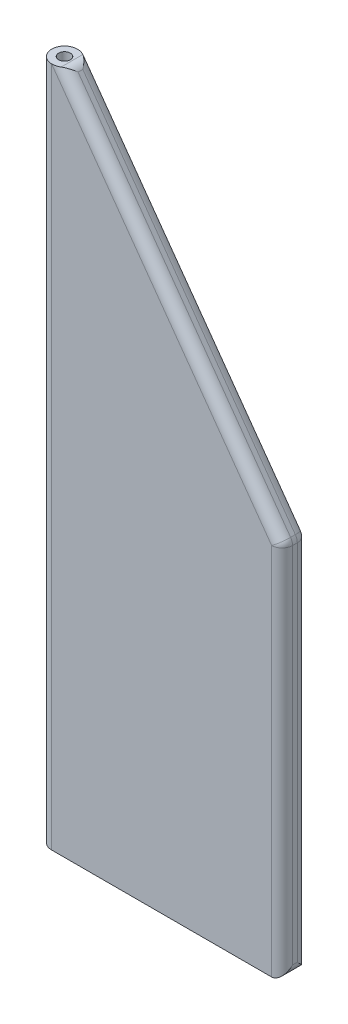
ISO-10303-21;
HEADER;
FILE_DESCRIPTION(('STEP AP214'),'2;1');
FILE_NAME('part.step','',(''),(''),'','','');
FILE_SCHEMA(('AUTOMOTIVE_DESIGN { 1 0 10303 214 1 1 1 1 }'));
ENDSEC;
DATA;
#1=APPLICATION_CONTEXT('core data for automotive mechanical design processes');
#2=APPLICATION_PROTOCOL_DEFINITION('international standard','automotive_design',2000,#1);
#3=PRODUCT_CONTEXT('',#1,'mechanical');
#4=PRODUCT('Part','Part','',(#3));
#5=PRODUCT_RELATED_PRODUCT_CATEGORY('part','',(#4));
#6=PRODUCT_DEFINITION_FORMATION('','',#4);
#7=PRODUCT_DEFINITION_CONTEXT('part definition',#1,'design');
#8=PRODUCT_DEFINITION('design','',#6,#7);
#9=PRODUCT_DEFINITION_SHAPE('','',#8);
#10=(LENGTH_UNIT() NAMED_UNIT(*) SI_UNIT(.MILLI.,.METRE.));
#11=(NAMED_UNIT(*) PLANE_ANGLE_UNIT() SI_UNIT($,.RADIAN.));
#12=(NAMED_UNIT(*) SI_UNIT($,.STERADIAN.) SOLID_ANGLE_UNIT());
#13=UNCERTAINTY_MEASURE_WITH_UNIT(LENGTH_MEASURE(1.E-05),#10,'distance_accuracy_value','');
#14=(GEOMETRIC_REPRESENTATION_CONTEXT(3) GLOBAL_UNCERTAINTY_ASSIGNED_CONTEXT((#13)) GLOBAL_UNIT_ASSIGNED_CONTEXT((#10,
#11,#12)) REPRESENTATION_CONTEXT('',''));
#15=CARTESIAN_POINT('',(0.,0.,0.));
#16=DIRECTION('',(0.,0.,1.));
#17=DIRECTION('',(1.,0.,0.));
#18=AXIS2_PLACEMENT_3D('',#15,#16,#17);
#19=CARTESIAN_POINT('',(0.,65.,0.));
#20=DIRECTION('',(0.,-1.,0.));
#21=DIRECTION('',(0.,0.,-1.));
#22=AXIS2_PLACEMENT_3D('',#19,#20,#21);
#23=CYLINDRICAL_SURFACE('',#22,1.225);
#24=DIRECTION('',(0.,-1.,0.));
#25=VECTOR('',#24,1.);
#26=CARTESIAN_POINT('',(0.,36.,1.225));
#27=LINE('',#26,#25);
#28=CARTESIAN_POINT('',(0.,64.992850620897,1.225));
#29=VERTEX_POINT('',#28);
#30=CARTESIAN_POINT('',(0.,0.,1.225));
#31=VERTEX_POINT('',#30);
#32=EDGE_CURVE('E139',#29,#31,#27,.T.);
#33=ORIENTED_EDGE('',*,*,#32,.F.);
#34=CARTESIAN_POINT('',(0.0459834894753985,65.,1.22413664216811));
#35=CARTESIAN_POINT('',(0.0337902166278973,64.9981051293374,1.22459461310516));
#36=CARTESIAN_POINT('',(0.0215947006379805,64.9962091906921,1.22487038492549));
#37=CARTESIAN_POINT('',(0.00626477557659393,64.9938250667613,1.22498798542231));
#38=CARTESIAN_POINT('',(0.00313246174137936,64.9933378790389,1.22499999954595));
#39=CARTESIAN_POINT('',(0.,64.992850620897,1.225));
#40=B_SPLINE_CURVE_WITH_KNOTS('',3,(#34,#35,#36,#37,#38,#39),.UNSPECIFIED.,.F.,.F.,(4,2,4),(0.,
0.0370352695863958,0.0465452630461256),.UNSPECIFIED.);
#41=CARTESIAN_POINT('',(0.0459834894753985,65.,1.22413664216811));
#42=VERTEX_POINT('',#41);
#43=EDGE_CURVE('E11',#29,#42,#40,.F.);
#44=ORIENTED_EDGE('',*,*,#43,.T.);
#45=CARTESIAN_POINT('',(0.,65.,0.));
#46=DIRECTION('',(0.,1.,0.));
#47=DIRECTION('',(0.,0.,1.));
#48=AXIS2_PLACEMENT_3D('',#45,#46,#47);
#49=CIRCLE('',#48,1.225);
#50=CARTESIAN_POINT('',(0.0459834894745959,65.,-1.22413664216814));
#51=VERTEX_POINT('',#50);
#52=EDGE_CURVE('E163',#51,#42,#49,.T.);
#53=ORIENTED_EDGE('',*,*,#52,.F.);
#54=CARTESIAN_POINT('',(0.0459834894745959,65.,-1.22413664216814));
#55=CARTESIAN_POINT('',(0.033790216627214,64.9981051293383,-1.22459461310517));
#56=CARTESIAN_POINT('',(0.0215947006375322,64.9962091906932,-1.22487038492549));
#57=CARTESIAN_POINT('',(0.00626477557651987,64.9938250667617,-1.22498798542231));
#58=CARTESIAN_POINT('',(0.0031324617413366,64.9933378790392,-1.22499999954595));
#59=CARTESIAN_POINT('',(0.,64.992850620897,-1.225));
#60=B_SPLINE_CURVE_WITH_KNOTS('',3,(#54,#55,#56,#57,#58,#59),.UNSPECIFIED.,.F.,.F.,(4,2,4),(0.,
0.0370352695856073,0.0465452630453359),.UNSPECIFIED.);
#61=CARTESIAN_POINT('',(0.,64.992850620897,-1.225));
#62=VERTEX_POINT('',#61);
#63=EDGE_CURVE('E53',#51,#62,#60,.T.);
#64=ORIENTED_EDGE('',*,*,#63,.T.);
#65=DIRECTION('',(0.,-1.,0.));
#66=VECTOR('',#65,1.);
#67=CARTESIAN_POINT('',(0.,36.,-1.225));
#68=LINE('',#67,#66);
#69=CARTESIAN_POINT('',(0.,0.,-1.225));
#70=VERTEX_POINT('',#69);
#71=EDGE_CURVE('E130',#62,#70,#68,.T.);
#72=ORIENTED_EDGE('',*,*,#71,.T.);
#73=CARTESIAN_POINT('',(0.,0.,0.));
#74=DIRECTION('',(0.,1.,0.));
#75=DIRECTION('',(0.,0.,1.));
#76=AXIS2_PLACEMENT_3D('',#73,#74,#75);
#77=CIRCLE('',#76,1.225);
#78=EDGE_CURVE('E133',#70,#31,#77,.T.);
#79=ORIENTED_EDGE('',*,*,#78,.T.);
#80=EDGE_LOOP('',(#33,#44,#53,#64,#72,#79));
#81=FACE_BOUND('',#80,.T.);
#82=ADVANCED_FACE('F42',(#81),#23,.T.);
#83=CARTESIAN_POINT('',(0.,65.,0.));
#84=DIRECTION('',(0.,-1.,0.));
#85=DIRECTION('',(0.,0.,-1.));
#86=AXIS2_PLACEMENT_3D('',#83,#84,#85);
#87=CYLINDRICAL_SURFACE('',#86,0.56);
#88=CARTESIAN_POINT('',(0.,65.,0.));
#89=DIRECTION('',(0.,1.,0.));
#90=DIRECTION('',(0.,0.,1.));
#91=AXIS2_PLACEMENT_3D('',#88,#89,#90);
#92=CIRCLE('',#91,0.56);
#93=CARTESIAN_POINT('',(0.,65.,0.56));
#94=VERTEX_POINT('',#93);
#95=EDGE_CURVE('E149',#94,#94,#92,.T.);
#96=ORIENTED_EDGE('',*,*,#95,.T.);
#97=EDGE_LOOP('',(#96));
#98=FACE_BOUND('',#97,.T.);
#99=CARTESIAN_POINT('',(0.,0.,0.));
#100=DIRECTION('',(0.,1.,0.));
#101=DIRECTION('',(0.,0.,1.));
#102=AXIS2_PLACEMENT_3D('',#99,#100,#101);
#103=CIRCLE('',#102,0.56);
#104=CARTESIAN_POINT('',(0.,0.,0.56));
#105=VERTEX_POINT('',#104);
#106=EDGE_CURVE('E150',#105,#105,#103,.T.);
#107=ORIENTED_EDGE('',*,*,#106,.F.);
#108=EDGE_LOOP('',(#107));
#109=FACE_BOUND('',#108,.T.);
#110=ADVANCED_FACE('F227',(#98,#109),#87,.F.);
#111=CARTESIAN_POINT('',(0.,65.,0.));
#112=DIRECTION('',(0.,1.,0.));
#113=DIRECTION('',(0.,0.,1.));
#114=AXIS2_PLACEMENT_3D('',#111,#112,#113);
#115=PLANE('',#114);
#116=ORIENTED_EDGE('',*,*,#95,.F.);
#117=EDGE_LOOP('',(#116));
#118=FACE_BOUND('',#117,.T.);
#119=CARTESIAN_POINT('',(-0.00512166727121769,65.,-0.225000000000003));
#120=DIRECTION('',(0.,1.,0.));
#121=DIRECTION('',(1.,0.,0.));
#122=AXIS2_PLACEMENT_3D('',#119,#120,#121);
#123=ELLIPSE('',#122,1.23012166727122,1.);
#124=CARTESIAN_POINT('',(0.711257643073609,65.,-1.03792771813239));
#125=VERTEX_POINT('',#124);
#126=EDGE_CURVE('E198',#125,#51,#123,.T.);
#127=ORIENTED_EDGE('',*,*,#126,.T.);
#128=ORIENTED_EDGE('',*,*,#52,.T.);
#129=CARTESIAN_POINT('',(-0.00512166727121774,65.,0.225));
#130=DIRECTION('',(0.,1.,0.));
#131=DIRECTION('',(1.,0.,0.));
#132=AXIS2_PLACEMENT_3D('',#129,#130,#131);
#133=ELLIPSE('',#132,1.23012166727122,1.);
#134=CARTESIAN_POINT('',(0.711257643073609,65.,1.03792771813239));
#135=VERTEX_POINT('',#134);
#136=EDGE_CURVE('E192',#42,#135,#133,.T.);
#137=ORIENTED_EDGE('',*,*,#136,.T.);
#138=DIRECTION('',(0.,0.,-1.));
#139=VECTOR('',#138,1.);
#140=CARTESIAN_POINT('',(0.711257643073609,65.,-1.225));
#141=LINE('',#140,#139);
#142=EDGE_CURVE('E195',#135,#125,#141,.T.);
#143=ORIENTED_EDGE('',*,*,#142,.T.);
#144=EDGE_LOOP('',(#127,#128,#137,#143));
#145=FACE_BOUND('',#144,.T.);
#146=ADVANCED_FACE('F232',(#118,#145),#115,.T.);
#147=CARTESIAN_POINT('',(0.,0.,0.));
#148=DIRECTION('',(0.,1.,0.));
#149=DIRECTION('',(0.,0.,1.));
#150=AXIS2_PLACEMENT_3D('',#147,#148,#149);
#151=PLANE('',#150);
#152=ORIENTED_EDGE('',*,*,#106,.T.);
#153=EDGE_LOOP('',(#152));
#154=FACE_BOUND('',#153,.T.);
#155=DIRECTION('',(1.,0.,0.));
#156=VECTOR('',#155,1.);
#157=CARTESIAN_POINT('',(0.,0.,-1.225));
#158=LINE('',#157,#156);
#159=CARTESIAN_POINT('',(21.,0.,-1.225));
#160=VERTEX_POINT('',#159);
#161=EDGE_CURVE('E140',#70,#160,#158,.T.);
#162=ORIENTED_EDGE('',*,*,#161,.T.);
#163=DIRECTION('',(0.,0.,1.));
#164=VECTOR('',#163,1.);
#165=CARTESIAN_POINT('',(21.,0.,1.225));
#166=LINE('',#165,#164);
#167=CARTESIAN_POINT('',(21.,0.,1.225));
#168=VERTEX_POINT('',#167);
#169=EDGE_CURVE('E190',#160,#168,#166,.T.);
#170=ORIENTED_EDGE('',*,*,#169,.T.);
#171=DIRECTION('',(-1.,0.,0.));
#172=VECTOR('',#171,1.);
#173=CARTESIAN_POINT('',(0.,0.,1.225));
#174=LINE('',#173,#172);
#175=EDGE_CURVE('E148',#168,#31,#174,.T.);
#176=ORIENTED_EDGE('',*,*,#175,.T.);
#177=ORIENTED_EDGE('',*,*,#78,.F.);
#178=EDGE_LOOP('',(#162,#170,#176,#177));
#179=FACE_BOUND('',#178,.T.);
#180=ADVANCED_FACE('F145',(#154,#179),#151,.F.);
#181=CARTESIAN_POINT('',(0.,36.,1.225));
#182=DIRECTION('',(0.,0.,1.));
#183=DIRECTION('',(1.,0.,0.));
#184=AXIS2_PLACEMENT_3D('',#181,#182,#183);
#185=PLANE('',#184);
#186=ORIENTED_EDGE('',*,*,#175,.F.);
#187=DIRECTION('',(0.,-1.,0.));
#188=VECTOR('',#187,1.);
#189=CARTESIAN_POINT('',(21.,36.,1.225));
#190=LINE('',#189,#188);
#191=CARTESIAN_POINT('',(21.,35.6787711985143,1.225));
#192=VERTEX_POINT('',#191);
#193=EDGE_CURVE('E182',#168,#192,#190,.F.);
#194=ORIENTED_EDGE('',*,*,#193,.T.);
#195=DIRECTION('',(-0.582364598075873,0.812927718132386,0.));
#196=VECTOR('',#195,1.);
#197=CARTESIAN_POINT('',(0.412072281867616,64.4176354019241,1.225));
#198=LINE('',#197,#196);
#199=EDGE_CURVE('E179',#192,#29,#198,.T.);
#200=ORIENTED_EDGE('',*,*,#199,.T.);
#201=ORIENTED_EDGE('',*,*,#32,.T.);
#202=EDGE_LOOP('',(#186,#194,#200,#201));
#203=FACE_BOUND('',#202,.T.);
#204=ADVANCED_FACE('F321',(#203),#185,.T.);
#205=CARTESIAN_POINT('',(22.,36.,0.));
#206=DIRECTION('',(1.,0.,0.));
#207=DIRECTION('',(0.,0.,-1.));
#208=AXIS2_PLACEMENT_3D('',#205,#206,#207);
#209=PLANE('',#208);
#210=DIRECTION('',(0.,-1.,0.));
#211=VECTOR('',#210,1.);
#212=CARTESIAN_POINT('',(22.,36.,0.224999999999998));
#213=LINE('',#212,#211);
#214=CARTESIAN_POINT('',(22.,35.6787711985143,0.224999999999998));
#215=VERTEX_POINT('',#214);
#216=CARTESIAN_POINT('',(22.,1.,0.224999999999998));
#217=VERTEX_POINT('',#216);
#218=EDGE_CURVE('E173',#215,#217,#213,.T.);
#219=ORIENTED_EDGE('',*,*,#218,.T.);
#220=DIRECTION('',(0.,0.,1.));
#221=VECTOR('',#220,1.);
#222=CARTESIAN_POINT('',(22.,1.,-1.225));
#223=LINE('',#222,#221);
#224=CARTESIAN_POINT('',(22.,1.,-0.224999999999998));
#225=VERTEX_POINT('',#224);
#226=EDGE_CURVE('E177',#217,#225,#223,.F.);
#227=ORIENTED_EDGE('',*,*,#226,.T.);
#228=DIRECTION('',(0.,-1.,0.));
#229=VECTOR('',#228,1.);
#230=CARTESIAN_POINT('',(22.,36.,-0.224999999999998));
#231=LINE('',#230,#229);
#232=CARTESIAN_POINT('',(22.,35.6787711985143,-0.224999999999998));
#233=VERTEX_POINT('',#232);
#234=EDGE_CURVE('E170',#225,#233,#231,.F.);
#235=ORIENTED_EDGE('',*,*,#234,.T.);
#236=DIRECTION('',(0.,0.,1.));
#237=VECTOR('',#236,1.);
#238=CARTESIAN_POINT('',(22.,35.6787711985143,1.225));
#239=LINE('',#238,#237);
#240=EDGE_CURVE('E166',#233,#215,#239,.T.);
#241=ORIENTED_EDGE('',*,*,#240,.T.);
#242=EDGE_LOOP('',(#219,#227,#235,#241));
#243=FACE_BOUND('',#242,.T.);
#244=ADVANCED_FACE('F312',(#243),#209,.T.);
#245=CARTESIAN_POINT('',(0.,36.,-1.225));
#246=DIRECTION('',(0.,0.,-1.));
#247=DIRECTION('',(-1.,0.,0.));
#248=AXIS2_PLACEMENT_3D('',#245,#246,#247);
#249=PLANE('',#248);
#250=DIRECTION('',(-0.582364598075873,0.812927718132386,0.));
#251=VECTOR('',#250,1.);
#252=CARTESIAN_POINT('',(21.1870722818676,35.4176354019241,-1.225));
#253=LINE('',#252,#251);
#254=CARTESIAN_POINT('',(21.,35.6787711985143,-1.225));
#255=VERTEX_POINT('',#254);
#256=EDGE_CURVE('E185',#62,#255,#253,.F.);
#257=ORIENTED_EDGE('',*,*,#256,.T.);
#258=DIRECTION('',(0.,-1.,0.));
#259=VECTOR('',#258,1.);
#260=CARTESIAN_POINT('',(21.,36.,-1.225));
#261=LINE('',#260,#259);
#262=EDGE_CURVE('E154',#255,#160,#261,.T.);
#263=ORIENTED_EDGE('',*,*,#262,.T.);
#264=ORIENTED_EDGE('',*,*,#161,.F.);
#265=ORIENTED_EDGE('',*,*,#71,.F.);
#266=EDGE_LOOP('',(#257,#263,#264,#265));
#267=FACE_BOUND('',#266,.T.);
#268=ADVANCED_FACE('F152',(#267),#249,.T.);
#269=CARTESIAN_POINT('',(1.225,65.,37.6255494464026));
#270=DIRECTION('',(-0.812927718132386,-0.582364598075873,0.));
#271=DIRECTION('',(0.582364598075873,-0.812927718132386,0.));
#272=AXIS2_PLACEMENT_3D('',#269,#270,#271);
#273=PLANE('',#272);
#274=DIRECTION('',(-0.582364598075873,0.812927718132386,0.));
#275=VECTOR('',#274,1.);
#276=CARTESIAN_POINT('',(1.225,65.,-0.225000000000003));
#277=LINE('',#276,#275);
#278=CARTESIAN_POINT('',(21.8129277181324,36.2611357965902,-0.225000000000001));
#279=VERTEX_POINT('',#278);
#280=CARTESIAN_POINT('',(1.52418536120599,64.5823645980759,-0.225000000000003));
#281=VERTEX_POINT('',#280);
#282=EDGE_CURVE('E64',#279,#281,#277,.T.);
#283=ORIENTED_EDGE('',*,*,#282,.T.);
#284=DIRECTION('',(0.,0.,-1.));
#285=VECTOR('',#284,1.);
#286=CARTESIAN_POINT('',(1.52418536120599,64.5823645980759,1.225));
#287=LINE('',#286,#285);
#288=CARTESIAN_POINT('',(1.52418536120599,64.5823645980759,0.225));
#289=VERTEX_POINT('',#288);
#290=EDGE_CURVE('E208',#281,#289,#287,.F.);
#291=ORIENTED_EDGE('',*,*,#290,.T.);
#292=DIRECTION('',(-0.582364598075873,0.812927718132386,0.));
#293=VECTOR('',#292,1.);
#294=CARTESIAN_POINT('',(22.,36.,0.224999999999998));
#295=LINE('',#294,#293);
#296=CARTESIAN_POINT('',(21.8129277181324,36.2611357965902,0.224999999999998));
#297=VERTEX_POINT('',#296);
#298=EDGE_CURVE('E202',#289,#297,#295,.F.);
#299=ORIENTED_EDGE('',*,*,#298,.T.);
#300=DIRECTION('',(0.,0.,1.));
#301=VECTOR('',#300,1.);
#302=CARTESIAN_POINT('',(21.8129277181324,36.2611357965902,-1.225));
#303=LINE('',#302,#301);
#304=EDGE_CURVE('E69',#297,#279,#303,.F.);
#305=ORIENTED_EDGE('',*,*,#304,.T.);
#306=EDGE_LOOP('',(#283,#291,#299,#305));
#307=FACE_BOUND('',#306,.T.);
#308=ADVANCED_FACE('F268',(#307),#273,.F.);
#309=CARTESIAN_POINT('',(0.412072281867616,64.4176354019241,-0.225000000000003));
#310=DIRECTION('',(0.582364598075873,-0.812927718132386,0.));
#311=DIRECTION('',(0.812927718132386,0.582364598075873,0.));
#312=AXIS2_PLACEMENT_3D('',#309,#310,#311);
#313=CYLINDRICAL_SURFACE('',#312,1.);
#314=ORIENTED_EDGE('',*,*,#63,.F.);
#315=ORIENTED_EDGE('',*,*,#126,.F.);
#316=CARTESIAN_POINT('',(0.711257643073609,64.,-0.225000000000003));
#317=DIRECTION('',(0.411793956422428,-0.574826702105916,-0.707106781186547));
#318=DIRECTION('',(0.411793956422428,-0.574826702105916,0.707106781186547));
#319=AXIS2_PLACEMENT_3D('',#316,#317,#318);
#320=ELLIPSE('',#319,1.4142135623731,1.);
#321=EDGE_CURVE('E47',#281,#125,#320,.F.);
#322=ORIENTED_EDGE('',*,*,#321,.F.);
#323=ORIENTED_EDGE('',*,*,#282,.F.);
#324=CARTESIAN_POINT('',(21.,35.6787711985143,-0.224999999999998));
#325=DIRECTION('',(0.582364598075872,-0.812927718132386,0.));
#326=DIRECTION('',(0.812927718132386,0.582364598075872,0.));
#327=AXIS2_PLACEMENT_3D('',#324,#325,#326);
#328=CIRCLE('',#327,1.);
#329=EDGE_CURVE('E277',#255,#279,#328,.T.);
#330=ORIENTED_EDGE('',*,*,#329,.F.);
#331=ORIENTED_EDGE('',*,*,#256,.F.);
#332=EDGE_LOOP('',(#314,#315,#322,#323,#330,#331));
#333=FACE_BOUND('',#332,.T.);
#334=ADVANCED_FACE('F44',(#333),#313,.T.);
#335=CARTESIAN_POINT('',(0.711257643073609,64.,0.));
#336=DIRECTION('',(0.,0.,1.));
#337=DIRECTION('',(1.,0.,0.));
#338=AXIS2_PLACEMENT_3D('',#335,#336,#337);
#339=CYLINDRICAL_SURFACE('',#338,1.);
#340=ORIENTED_EDGE('',*,*,#321,.T.);
#341=ORIENTED_EDGE('',*,*,#142,.F.);
#342=CARTESIAN_POINT('',(0.711257643073607,64.,0.225));
#343=DIRECTION('',(0.411793956422428,-0.574826702105916,0.707106781186547));
#344=DIRECTION('',(0.411793956422428,-0.574826702105916,-0.707106781186547));
#345=AXIS2_PLACEMENT_3D('',#342,#343,#344);
#346=ELLIPSE('',#345,1.4142135623731,1.);
#347=EDGE_CURVE('E280',#289,#135,#346,.T.);
#348=ORIENTED_EDGE('',*,*,#347,.F.);
#349=ORIENTED_EDGE('',*,*,#290,.F.);
#350=EDGE_LOOP('',(#340,#341,#348,#349));
#351=FACE_BOUND('',#350,.T.);
#352=ADVANCED_FACE('F260',(#351),#339,.T.);
#353=CARTESIAN_POINT('',(21.,35.6787711985143,-0.224999999999998));
#354=DIRECTION('',(0.,0.,1.));
#355=DIRECTION('',(1.,0.,0.));
#356=AXIS2_PLACEMENT_3D('',#353,#354,#355);
#357=SPHERICAL_SURFACE('',#356,1.);
#358=CARTESIAN_POINT('',(21.,35.6787711985143,-0.224999999999998));
#359=DIRECTION('',(0.,1.,0.));
#360=DIRECTION('',(0.,0.,1.));
#361=AXIS2_PLACEMENT_3D('',#358,#359,#360);
#362=CIRCLE('',#361,1.);
#363=EDGE_CURVE('E290',#255,#233,#362,.F.);
#364=ORIENTED_EDGE('',*,*,#363,.F.);
#365=ORIENTED_EDGE('',*,*,#329,.T.);
#366=CARTESIAN_POINT('',(21.,35.6787711985143,-0.225000000000001));
#367=DIRECTION('',(0.,0.,-1.));
#368=DIRECTION('',(0.,1.,0.));
#369=AXIS2_PLACEMENT_3D('',#366,#367,#368);
#370=CIRCLE('',#369,1.);
#371=EDGE_CURVE('E286',#233,#279,#370,.F.);
#372=ORIENTED_EDGE('',*,*,#371,.F.);
#373=EDGE_LOOP('',(#364,#365,#372));
#374=FACE_BOUND('',#373,.T.);
#375=ADVANCED_FACE('F257',(#374),#357,.T.);
#376=CARTESIAN_POINT('',(13.725804729842,45.832882526292,0.224999999999999));
#377=DIRECTION('',(0.582364598075873,-0.812927718132386,0.));
#378=DIRECTION('',(0.812927718132386,0.582364598075873,0.));
#379=AXIS2_PLACEMENT_3D('',#376,#377,#378);
#380=CYLINDRICAL_SURFACE('',#379,1.);
#381=ORIENTED_EDGE('',*,*,#43,.F.);
#382=ORIENTED_EDGE('',*,*,#199,.F.);
#383=CARTESIAN_POINT('',(21.,35.6787711985143,0.224999999999998));
#384=DIRECTION('',(0.582364598075875,-0.812927718132384,0.));
#385=DIRECTION('',(0.812927718132384,0.582364598075875,0.));
#386=AXIS2_PLACEMENT_3D('',#383,#384,#385);
#387=CIRCLE('',#386,1.);
#388=EDGE_CURVE('E293',#297,#192,#387,.T.);
#389=ORIENTED_EDGE('',*,*,#388,.F.);
#390=ORIENTED_EDGE('',*,*,#298,.F.);
#391=ORIENTED_EDGE('',*,*,#347,.T.);
#392=ORIENTED_EDGE('',*,*,#136,.F.);
#393=EDGE_LOOP('',(#381,#382,#389,#390,#391,#392));
#394=FACE_BOUND('',#393,.T.);
#395=ADVANCED_FACE('F252',(#394),#380,.T.);
#396=CARTESIAN_POINT('',(21.,35.6787711985143,0.));
#397=DIRECTION('',(0.,0.,-1.));
#398=DIRECTION('',(-1.,0.,0.));
#399=AXIS2_PLACEMENT_3D('',#396,#397,#398);
#400=CYLINDRICAL_SURFACE('',#399,1.);
#401=ORIENTED_EDGE('',*,*,#371,.T.);
#402=ORIENTED_EDGE('',*,*,#304,.F.);
#403=CARTESIAN_POINT('',(21.,35.6787711985143,0.224999999999998));
#404=DIRECTION('',(0.,0.,1.));
#405=DIRECTION('',(1.,0.,0.));
#406=AXIS2_PLACEMENT_3D('',#403,#404,#405);
#407=CIRCLE('',#406,1.);
#408=EDGE_CURVE('E296',#215,#297,#407,.T.);
#409=ORIENTED_EDGE('',*,*,#408,.F.);
#410=ORIENTED_EDGE('',*,*,#240,.F.);
#411=EDGE_LOOP('',(#401,#402,#409,#410));
#412=FACE_BOUND('',#411,.T.);
#413=ADVANCED_FACE('F249',(#412),#400,.T.);
#414=CARTESIAN_POINT('',(21.,36.,-0.224999999999998));
#415=DIRECTION('',(0.,-1.,0.));
#416=DIRECTION('',(0.,0.,-1.));
#417=AXIS2_PLACEMENT_3D('',#414,#415,#416);
#418=CYLINDRICAL_SURFACE('',#417,1.);
#419=ORIENTED_EDGE('',*,*,#363,.T.);
#420=ORIENTED_EDGE('',*,*,#234,.F.);
#421=CARTESIAN_POINT('',(21.,1.,-0.224999999999998));
#422=DIRECTION('',(0.,0.707106781186547,-0.707106781186547));
#423=DIRECTION('',(0.,-0.707106781186547,-0.707106781186547));
#424=AXIS2_PLACEMENT_3D('',#421,#422,#423);
#425=ELLIPSE('',#424,1.41421356237309,1.);
#426=EDGE_CURVE('E299',#160,#225,#425,.F.);
#427=ORIENTED_EDGE('',*,*,#426,.F.);
#428=ORIENTED_EDGE('',*,*,#262,.F.);
#429=EDGE_LOOP('',(#419,#420,#427,#428));
#430=FACE_BOUND('',#429,.T.);
#431=ADVANCED_FACE('F245',(#430),#418,.T.);
#432=CARTESIAN_POINT('',(21.,35.6787711985143,0.224999999999998));
#433=DIRECTION('',(0.,0.,1.));
#434=DIRECTION('',(1.,0.,0.));
#435=AXIS2_PLACEMENT_3D('',#432,#433,#434);
#436=SPHERICAL_SURFACE('',#435,1.);
#437=ORIENTED_EDGE('',*,*,#408,.T.);
#438=ORIENTED_EDGE('',*,*,#388,.T.);
#439=CARTESIAN_POINT('',(21.,35.6787711985143,0.224999999999998));
#440=DIRECTION('',(0.,1.,0.));
#441=DIRECTION('',(0.,0.,1.));
#442=AXIS2_PLACEMENT_3D('',#439,#440,#441);
#443=CIRCLE('',#442,1.);
#444=EDGE_CURVE('E302',#215,#192,#443,.F.);
#445=ORIENTED_EDGE('',*,*,#444,.F.);
#446=EDGE_LOOP('',(#437,#438,#445));
#447=FACE_BOUND('',#446,.T.);
#448=ADVANCED_FACE('F241',(#447),#436,.T.);
#449=CARTESIAN_POINT('',(21.,1.,0.));
#450=DIRECTION('',(0.,0.,-1.));
#451=DIRECTION('',(-1.,0.,0.));
#452=AXIS2_PLACEMENT_3D('',#449,#450,#451);
#453=CYLINDRICAL_SURFACE('',#452,1.);
#454=ORIENTED_EDGE('',*,*,#426,.T.);
#455=ORIENTED_EDGE('',*,*,#226,.F.);
#456=CARTESIAN_POINT('',(21.,1.,0.224999999999998));
#457=DIRECTION('',(0.,-0.707106781186547,-0.707106781186547));
#458=DIRECTION('',(0.,0.707106781186547,-0.707106781186547));
#459=AXIS2_PLACEMENT_3D('',#456,#457,#458);
#460=ELLIPSE('',#459,1.41421356237309,1.);
#461=EDGE_CURVE('E304',#168,#217,#460,.F.);
#462=ORIENTED_EDGE('',*,*,#461,.F.);
#463=ORIENTED_EDGE('',*,*,#169,.F.);
#464=EDGE_LOOP('',(#454,#455,#462,#463));
#465=FACE_BOUND('',#464,.T.);
#466=ADVANCED_FACE('F237',(#465),#453,.T.);
#467=CARTESIAN_POINT('',(21.,36.,0.224999999999998));
#468=DIRECTION('',(0.,-1.,0.));
#469=DIRECTION('',(0.,0.,-1.));
#470=AXIS2_PLACEMENT_3D('',#467,#468,#469);
#471=CYLINDRICAL_SURFACE('',#470,1.);
#472=ORIENTED_EDGE('',*,*,#444,.T.);
#473=ORIENTED_EDGE('',*,*,#193,.F.);
#474=ORIENTED_EDGE('',*,*,#461,.T.);
#475=ORIENTED_EDGE('',*,*,#218,.F.);
#476=EDGE_LOOP('',(#472,#473,#474,#475));
#477=FACE_BOUND('',#476,.T.);
#478=ADVANCED_FACE('F234',(#477),#471,.T.);
#479=CLOSED_SHELL('',(#82,#110,#146,#180,#204,#244,#268,#308,#334,#352,#375,#395,#413,#431,#448,
#466,#478));
#480=MANIFOLD_SOLID_BREP('B2',#479);
#481=ADVANCED_BREP_SHAPE_REPRESENTATION('',(#18,#480),#14);
#482=SHAPE_DEFINITION_REPRESENTATION(#9,#481);
ENDSEC;
END-ISO-10303-21;
